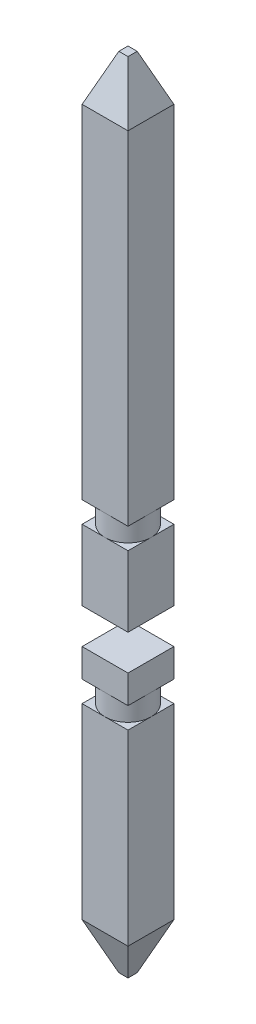
ISO-10303-21;
HEADER;
FILE_DESCRIPTION(('STEP AP214'),'2;1');
FILE_NAME('part.step','',(''),(''),'','','');
FILE_SCHEMA(('AUTOMOTIVE_DESIGN { 1 0 10303 214 1 1 1 1 }'));
ENDSEC;
DATA;
#1=APPLICATION_CONTEXT('core data for automotive mechanical design processes');
#2=APPLICATION_PROTOCOL_DEFINITION('international standard','automotive_design',2000,#1);
#3=PRODUCT_CONTEXT('',#1,'mechanical');
#4=PRODUCT('Part','Part','',(#3));
#5=PRODUCT_RELATED_PRODUCT_CATEGORY('part','',(#4));
#6=PRODUCT_DEFINITION_FORMATION('','',#4);
#7=PRODUCT_DEFINITION_CONTEXT('part definition',#1,'design');
#8=PRODUCT_DEFINITION('design','',#6,#7);
#9=PRODUCT_DEFINITION_SHAPE('','',#8);
#10=(LENGTH_UNIT() NAMED_UNIT(*) SI_UNIT(.MILLI.,.METRE.));
#11=(NAMED_UNIT(*) PLANE_ANGLE_UNIT() SI_UNIT($,.RADIAN.));
#12=(NAMED_UNIT(*) SI_UNIT($,.STERADIAN.) SOLID_ANGLE_UNIT());
#13=UNCERTAINTY_MEASURE_WITH_UNIT(LENGTH_MEASURE(1.E-05),#10,'distance_accuracy_value','');
#14=(GEOMETRIC_REPRESENTATION_CONTEXT(3) GLOBAL_UNCERTAINTY_ASSIGNED_CONTEXT((#13)) GLOBAL_UNIT_ASSIGNED_CONTEXT((#10,
#11,#12)) REPRESENTATION_CONTEXT('',''));
#15=CARTESIAN_POINT('',(0.,0.,0.));
#16=DIRECTION('',(0.,0.,1.));
#17=DIRECTION('',(1.,0.,0.));
#18=AXIS2_PLACEMENT_3D('',#15,#16,#17);
#19=CARTESIAN_POINT('',(-0.325,5.8,-0.325));
#20=DIRECTION('',(0.,1.,0.));
#21=DIRECTION('',(0.,0.,1.));
#22=AXIS2_PLACEMENT_3D('',#19,#20,#21);
#23=PLANE('',#22);
#24=DIRECTION('',(-1.,0.,0.));
#25=VECTOR('',#24,1.);
#26=CARTESIAN_POINT('',(-0.325,5.8,0.325));
#27=LINE('',#26,#25);
#28=CARTESIAN_POINT('',(0.325,5.8,0.325));
#29=VERTEX_POINT('',#28);
#30=CARTESIAN_POINT('',(0.,5.8,0.325));
#31=VERTEX_POINT('',#30);
#32=EDGE_CURVE('E208',#29,#31,#27,.T.);
#33=ORIENTED_EDGE('',*,*,#32,.T.);
#34=CARTESIAN_POINT('',(0.,5.8,0.));
#35=DIRECTION('',(0.,1.,0.));
#36=DIRECTION('',(0.,0.,1.));
#37=AXIS2_PLACEMENT_3D('',#34,#35,#36);
#38=CIRCLE('',#37,0.325);
#39=CARTESIAN_POINT('',(0.325,5.8,0.));
#40=VERTEX_POINT('',#39);
#41=EDGE_CURVE('E191',#31,#40,#38,.T.);
#42=ORIENTED_EDGE('',*,*,#41,.T.);
#43=DIRECTION('',(0.,0.,1.));
#44=VECTOR('',#43,1.);
#45=CARTESIAN_POINT('',(0.325,5.8,-0.325));
#46=LINE('',#45,#44);
#47=EDGE_CURVE('E202',#40,#29,#46,.T.);
#48=ORIENTED_EDGE('',*,*,#47,.T.);
#49=EDGE_LOOP('',(#33,#42,#48));
#50=FACE_BOUND('',#49,.T.);
#51=ADVANCED_FACE('F47',(#50),#23,.F.);
#52=CARTESIAN_POINT('',(0.325,5.8,-0.325));
#53=VERTEX_POINT('',#52);
#54=EDGE_CURVE('E199',#53,#40,#46,.T.);
#55=ORIENTED_EDGE('',*,*,#54,.T.);
#56=CARTESIAN_POINT('',(0.,5.8,-0.325));
#57=VERTEX_POINT('',#56);
#58=EDGE_CURVE('E197',#40,#57,#38,.T.);
#59=ORIENTED_EDGE('',*,*,#58,.T.);
#60=DIRECTION('',(-1.,0.,0.));
#61=VECTOR('',#60,1.);
#62=CARTESIAN_POINT('',(-0.325,5.8,-0.325));
#63=LINE('',#62,#61);
#64=EDGE_CURVE('E212',#53,#57,#63,.T.);
#65=ORIENTED_EDGE('',*,*,#64,.F.);
#66=EDGE_LOOP('',(#55,#59,#65));
#67=FACE_BOUND('',#66,.T.);
#68=ADVANCED_FACE('F296',(#67),#23,.F.);
#69=CARTESIAN_POINT('',(-0.325,5.8,-0.325));
#70=VERTEX_POINT('',#69);
#71=EDGE_CURVE('E216',#57,#70,#63,.T.);
#72=ORIENTED_EDGE('',*,*,#71,.F.);
#73=CARTESIAN_POINT('',(-0.325,5.8,0.));
#74=VERTEX_POINT('',#73);
#75=EDGE_CURVE('E329',#57,#74,#38,.T.);
#76=ORIENTED_EDGE('',*,*,#75,.T.);
#77=DIRECTION('',(0.,0.,1.));
#78=VECTOR('',#77,1.);
#79=CARTESIAN_POINT('',(-0.325,5.8,-0.325));
#80=LINE('',#79,#78);
#81=EDGE_CURVE('E203',#70,#74,#80,.T.);
#82=ORIENTED_EDGE('',*,*,#81,.F.);
#83=EDGE_LOOP('',(#72,#76,#82));
#84=FACE_BOUND('',#83,.T.);
#85=ADVANCED_FACE('F303',(#84),#23,.F.);
#86=CARTESIAN_POINT('',(0.325,11.3,0.325));
#87=DIRECTION('',(-1.,0.,0.));
#88=DIRECTION('',(0.,0.,1.));
#89=AXIS2_PLACEMENT_3D('',#86,#87,#88);
#90=PLANE('',#89);
#91=DIRECTION('',(0.,-1.,0.));
#92=VECTOR('',#91,1.);
#93=CARTESIAN_POINT('',(0.325,11.3,-0.325));
#94=LINE('',#93,#92);
#95=CARTESIAN_POINT('',(0.325,10.65,-0.325));
#96=VERTEX_POINT('',#95);
#97=EDGE_CURVE('E219',#96,#53,#94,.T.);
#98=ORIENTED_EDGE('',*,*,#97,.F.);
#99=DIRECTION('',(0.,0.,1.));
#100=VECTOR('',#99,1.);
#101=CARTESIAN_POINT('',(0.325,10.65,0.325));
#102=LINE('',#101,#100);
#103=CARTESIAN_POINT('',(0.325,10.65,0.325));
#104=VERTEX_POINT('',#103);
#105=EDGE_CURVE('E12',#96,#104,#102,.T.);
#106=ORIENTED_EDGE('',*,*,#105,.T.);
#107=DIRECTION('',(0.,-1.,0.));
#108=VECTOR('',#107,1.);
#109=CARTESIAN_POINT('',(0.325,11.3,0.325));
#110=LINE('',#109,#108);
#111=EDGE_CURVE('E196',#104,#29,#110,.T.);
#112=ORIENTED_EDGE('',*,*,#111,.T.);
#113=ORIENTED_EDGE('',*,*,#47,.F.);
#114=ORIENTED_EDGE('',*,*,#54,.F.);
#115=EDGE_LOOP('',(#98,#106,#112,#113,#114));
#116=FACE_BOUND('',#115,.T.);
#117=ADVANCED_FACE('F318',(#116),#90,.F.);
#118=CARTESIAN_POINT('',(-0.325,11.3,-0.325));
#119=DIRECTION('',(0.,0.,1.));
#120=DIRECTION('',(1.,0.,0.));
#121=AXIS2_PLACEMENT_3D('',#118,#119,#120);
#122=PLANE('',#121);
#123=DIRECTION('',(0.,-1.,0.));
#124=VECTOR('',#123,1.);
#125=CARTESIAN_POINT('',(-0.325,11.3,-0.325));
#126=LINE('',#125,#124);
#127=CARTESIAN_POINT('',(-0.325,10.65,-0.325));
#128=VERTEX_POINT('',#127);
#129=EDGE_CURVE('E215',#128,#70,#126,.T.);
#130=ORIENTED_EDGE('',*,*,#129,.F.);
#131=DIRECTION('',(1.,0.,0.));
#132=VECTOR('',#131,1.);
#133=CARTESIAN_POINT('',(-0.325,10.65,-0.325));
#134=LINE('',#133,#132);
#135=EDGE_CURVE('E231',#128,#96,#134,.T.);
#136=ORIENTED_EDGE('',*,*,#135,.T.);
#137=ORIENTED_EDGE('',*,*,#97,.T.);
#138=ORIENTED_EDGE('',*,*,#64,.T.);
#139=ORIENTED_EDGE('',*,*,#71,.T.);
#140=EDGE_LOOP('',(#130,#136,#137,#138,#139));
#141=FACE_BOUND('',#140,.T.);
#142=ADVANCED_FACE('F323',(#141),#122,.F.);
#143=CARTESIAN_POINT('',(-0.325,11.3,0.325));
#144=DIRECTION('',(1.,0.,0.));
#145=DIRECTION('',(0.,0.,-1.));
#146=AXIS2_PLACEMENT_3D('',#143,#144,#145);
#147=PLANE('',#146);
#148=DIRECTION('',(0.,-1.,0.));
#149=VECTOR('',#148,1.);
#150=CARTESIAN_POINT('',(-0.325,11.3,0.325));
#151=LINE('',#150,#149);
#152=CARTESIAN_POINT('',(-0.325,10.65,0.325));
#153=VERTEX_POINT('',#152);
#154=CARTESIAN_POINT('',(-0.325,5.8,0.325));
#155=VERTEX_POINT('',#154);
#156=EDGE_CURVE('E206',#153,#155,#151,.T.);
#157=ORIENTED_EDGE('',*,*,#156,.F.);
#158=DIRECTION('',(0.,0.,-1.));
#159=VECTOR('',#158,1.);
#160=CARTESIAN_POINT('',(-0.325,10.65,0.325));
#161=LINE('',#160,#159);
#162=EDGE_CURVE('E234',#153,#128,#161,.T.);
#163=ORIENTED_EDGE('',*,*,#162,.T.);
#164=ORIENTED_EDGE('',*,*,#129,.T.);
#165=ORIENTED_EDGE('',*,*,#81,.T.);
#166=EDGE_CURVE('E207',#74,#155,#80,.T.);
#167=ORIENTED_EDGE('',*,*,#166,.T.);
#168=EDGE_LOOP('',(#157,#163,#164,#165,#167));
#169=FACE_BOUND('',#168,.T.);
#170=ADVANCED_FACE('F343',(#169),#147,.F.);
#171=CARTESIAN_POINT('',(-0.325,11.3,0.325));
#172=DIRECTION('',(0.,0.,-1.));
#173=DIRECTION('',(-1.,0.,0.));
#174=AXIS2_PLACEMENT_3D('',#171,#172,#173);
#175=PLANE('',#174);
#176=ORIENTED_EDGE('',*,*,#111,.F.);
#177=DIRECTION('',(-1.,0.,0.));
#178=VECTOR('',#177,1.);
#179=CARTESIAN_POINT('',(-0.325,10.65,0.325));
#180=LINE('',#179,#178);
#181=EDGE_CURVE('E57',#104,#153,#180,.T.);
#182=ORIENTED_EDGE('',*,*,#181,.T.);
#183=ORIENTED_EDGE('',*,*,#156,.T.);
#184=EDGE_CURVE('E211',#31,#155,#27,.T.);
#185=ORIENTED_EDGE('',*,*,#184,.F.);
#186=ORIENTED_EDGE('',*,*,#32,.F.);
#187=EDGE_LOOP('',(#176,#182,#183,#185,#186));
#188=FACE_BOUND('',#187,.T.);
#189=ADVANCED_FACE('F314',(#188),#175,.F.);
#190=CARTESIAN_POINT('',(0.,11.3,0.));
#191=DIRECTION('',(0.,-1.,0.));
#192=DIRECTION('',(0.,0.,-1.));
#193=AXIS2_PLACEMENT_3D('',#190,#191,#192);
#194=PLANE('',#193);
#195=DIRECTION('',(0.,0.,-1.));
#196=VECTOR('',#195,1.);
#197=CARTESIAN_POINT('',(0.0649999999999989,11.3,0.));
#198=LINE('',#197,#196);
#199=CARTESIAN_POINT('',(0.0649999999999989,11.3,0.0649999999999989));
#200=VERTEX_POINT('',#199);
#201=CARTESIAN_POINT('',(0.0649999999999989,11.3,-0.0649999999999989));
#202=VERTEX_POINT('',#201);
#203=EDGE_CURVE('E222',#200,#202,#198,.T.);
#204=ORIENTED_EDGE('',*,*,#203,.T.);
#205=DIRECTION('',(-1.,0.,0.));
#206=VECTOR('',#205,1.);
#207=CARTESIAN_POINT('',(0.,11.3,-0.0649999999999989));
#208=LINE('',#207,#206);
#209=CARTESIAN_POINT('',(-0.0649999999999989,11.3,-0.0649999999999989));
#210=VERTEX_POINT('',#209);
#211=EDGE_CURVE('E228',#202,#210,#208,.T.);
#212=ORIENTED_EDGE('',*,*,#211,.T.);
#213=DIRECTION('',(0.,0.,1.));
#214=VECTOR('',#213,1.);
#215=CARTESIAN_POINT('',(-0.0649999999999989,11.3,0.));
#216=LINE('',#215,#214);
#217=CARTESIAN_POINT('',(-0.0649999999999989,11.3,0.0649999999999989));
#218=VERTEX_POINT('',#217);
#219=EDGE_CURVE('E226',#210,#218,#216,.T.);
#220=ORIENTED_EDGE('',*,*,#219,.T.);
#221=DIRECTION('',(1.,0.,0.));
#222=VECTOR('',#221,1.);
#223=CARTESIAN_POINT('',(0.,11.3,0.0649999999999989));
#224=LINE('',#223,#222);
#225=EDGE_CURVE('E224',#218,#200,#224,.T.);
#226=ORIENTED_EDGE('',*,*,#225,.T.);
#227=EDGE_LOOP('',(#204,#212,#220,#226));
#228=FACE_BOUND('',#227,.T.);
#229=ADVANCED_FACE('F308',(#228),#194,.F.);
#230=ORIENTED_EDGE('',*,*,#166,.F.);
#231=EDGE_CURVE('E198',#74,#31,#38,.T.);
#232=ORIENTED_EDGE('',*,*,#231,.T.);
#233=ORIENTED_EDGE('',*,*,#184,.T.);
#234=EDGE_LOOP('',(#230,#232,#233));
#235=FACE_BOUND('',#234,.T.);
#236=ADVANCED_FACE('F299',(#235),#23,.F.);
#237=CARTESIAN_POINT('',(0.,6.71923881554251,0.));
#238=DIRECTION('',(0.,-1.,0.));
#239=DIRECTION('',(0.,0.,-1.));
#240=AXIS2_PLACEMENT_3D('',#237,#238,#239);
#241=CYLINDRICAL_SURFACE('',#240,0.325);
#242=CARTESIAN_POINT('',(0.,5.5,0.));
#243=DIRECTION('',(0.,1.,0.));
#244=DIRECTION('',(0.,0.,1.));
#245=AXIS2_PLACEMENT_3D('',#242,#243,#244);
#246=CIRCLE('',#245,0.325);
#247=CARTESIAN_POINT('',(0.,5.5,0.325));
#248=VERTEX_POINT('',#247);
#249=CARTESIAN_POINT('',(0.325,5.5,0.));
#250=VERTEX_POINT('',#249);
#251=EDGE_CURVE('E188',#248,#250,#246,.T.);
#252=ORIENTED_EDGE('',*,*,#251,.T.);
#253=CARTESIAN_POINT('',(0.,5.5,-0.325));
#254=VERTEX_POINT('',#253);
#255=EDGE_CURVE('E192',#250,#254,#246,.T.);
#256=ORIENTED_EDGE('',*,*,#255,.T.);
#257=CARTESIAN_POINT('',(-0.325,5.5,0.));
#258=VERTEX_POINT('',#257);
#259=EDGE_CURVE('E154',#254,#258,#246,.T.);
#260=ORIENTED_EDGE('',*,*,#259,.T.);
#261=EDGE_CURVE('E193',#258,#248,#246,.T.);
#262=ORIENTED_EDGE('',*,*,#261,.T.);
#263=EDGE_LOOP('',(#252,#256,#260,#262));
#264=FACE_BOUND('',#263,.T.);
#265=ORIENTED_EDGE('',*,*,#41,.F.);
#266=ORIENTED_EDGE('',*,*,#231,.F.);
#267=ORIENTED_EDGE('',*,*,#75,.F.);
#268=ORIENTED_EDGE('',*,*,#58,.F.);
#269=EDGE_LOOP('',(#265,#266,#267,#268));
#270=FACE_BOUND('',#269,.T.);
#271=ADVANCED_FACE('F277',(#264,#270),#241,.T.);
#272=CARTESIAN_POINT('',(-0.325,5.5,-0.325));
#273=DIRECTION('',(0.,-1.,0.));
#274=DIRECTION('',(0.,0.,-1.));
#275=AXIS2_PLACEMENT_3D('',#272,#273,#274);
#276=PLANE('',#275);
#277=ORIENTED_EDGE('',*,*,#251,.F.);
#278=DIRECTION('',(1.,0.,0.));
#279=VECTOR('',#278,1.);
#280=CARTESIAN_POINT('',(-0.325,5.5,0.325));
#281=LINE('',#280,#279);
#282=CARTESIAN_POINT('',(0.325,5.5,0.325));
#283=VERTEX_POINT('',#282);
#284=EDGE_CURVE('E247',#248,#283,#281,.T.);
#285=ORIENTED_EDGE('',*,*,#284,.T.);
#286=DIRECTION('',(0.,0.,1.));
#287=VECTOR('',#286,1.);
#288=CARTESIAN_POINT('',(0.325,5.5,-0.325));
#289=LINE('',#288,#287);
#290=EDGE_CURVE('E169',#250,#283,#289,.T.);
#291=ORIENTED_EDGE('',*,*,#290,.F.);
#292=EDGE_LOOP('',(#277,#285,#291));
#293=FACE_BOUND('',#292,.T.);
#294=ADVANCED_FACE('F283',(#293),#276,.F.);
#295=ORIENTED_EDGE('',*,*,#255,.F.);
#296=CARTESIAN_POINT('',(0.325,5.5,-0.325));
#297=VERTEX_POINT('',#296);
#298=EDGE_CURVE('E187',#297,#250,#289,.T.);
#299=ORIENTED_EDGE('',*,*,#298,.F.);
#300=DIRECTION('',(1.,0.,0.));
#301=VECTOR('',#300,1.);
#302=CARTESIAN_POINT('',(-0.325,5.5,-0.325));
#303=LINE('',#302,#301);
#304=EDGE_CURVE('E160',#254,#297,#303,.T.);
#305=ORIENTED_EDGE('',*,*,#304,.F.);
#306=EDGE_LOOP('',(#295,#299,#305));
#307=FACE_BOUND('',#306,.T.);
#308=ADVANCED_FACE('F281',(#307),#276,.F.);
#309=ORIENTED_EDGE('',*,*,#259,.F.);
#310=CARTESIAN_POINT('',(-0.325,5.5,-0.325));
#311=VERTEX_POINT('',#310);
#312=EDGE_CURVE('E149',#311,#254,#303,.T.);
#313=ORIENTED_EDGE('',*,*,#312,.F.);
#314=DIRECTION('',(0.,0.,1.));
#315=VECTOR('',#314,1.);
#316=CARTESIAN_POINT('',(-0.325,5.5,-0.325));
#317=LINE('',#316,#315);
#318=EDGE_CURVE('E152',#311,#258,#317,.T.);
#319=ORIENTED_EDGE('',*,*,#318,.T.);
#320=EDGE_LOOP('',(#309,#313,#319));
#321=FACE_BOUND('',#320,.T.);
#322=ADVANCED_FACE('F151',(#321),#276,.F.);
#323=CARTESIAN_POINT('',(-0.325,4.5,-0.325));
#324=DIRECTION('',(0.,1.,0.));
#325=DIRECTION('',(0.,0.,1.));
#326=AXIS2_PLACEMENT_3D('',#323,#324,#325);
#327=PLANE('',#326);
#328=DIRECTION('',(-1.,0.,0.));
#329=VECTOR('',#328,1.);
#330=CARTESIAN_POINT('',(-0.325,4.5,0.325));
#331=LINE('',#330,#329);
#332=CARTESIAN_POINT('',(0.325,4.5,0.325));
#333=VERTEX_POINT('',#332);
#334=CARTESIAN_POINT('',(-0.325,4.5,0.325));
#335=VERTEX_POINT('',#334);
#336=EDGE_CURVE('E184',#333,#335,#331,.T.);
#337=ORIENTED_EDGE('',*,*,#336,.T.);
#338=DIRECTION('',(0.,0.,1.));
#339=VECTOR('',#338,1.);
#340=CARTESIAN_POINT('',(-0.325,4.5,-0.325));
#341=LINE('',#340,#339);
#342=CARTESIAN_POINT('',(-0.325,4.5,-0.325));
#343=VERTEX_POINT('',#342);
#344=EDGE_CURVE('E175',#343,#335,#341,.T.);
#345=ORIENTED_EDGE('',*,*,#344,.F.);
#346=DIRECTION('',(-1.,0.,0.));
#347=VECTOR('',#346,1.);
#348=CARTESIAN_POINT('',(-0.325,4.5,-0.325));
#349=LINE('',#348,#347);
#350=CARTESIAN_POINT('',(0.325,4.5,-0.325));
#351=VERTEX_POINT('',#350);
#352=EDGE_CURVE('E174',#351,#343,#349,.T.);
#353=ORIENTED_EDGE('',*,*,#352,.F.);
#354=DIRECTION('',(0.,0.,1.));
#355=VECTOR('',#354,1.);
#356=CARTESIAN_POINT('',(0.325,4.5,-0.325));
#357=LINE('',#356,#355);
#358=EDGE_CURVE('E262',#351,#333,#357,.T.);
#359=ORIENTED_EDGE('',*,*,#358,.T.);
#360=EDGE_LOOP('',(#337,#345,#353,#359));
#361=FACE_BOUND('',#360,.T.);
#362=ADVANCED_FACE('F268',(#361),#327,.F.);
#363=CARTESIAN_POINT('',(-0.325,11.3,0.325));
#364=DIRECTION('',(0.,0.,-1.));
#365=DIRECTION('',(-1.,0.,0.));
#366=AXIS2_PLACEMENT_3D('',#363,#364,#365);
#367=PLANE('',#366);
#368=DIRECTION('',(0.,-1.,0.));
#369=VECTOR('',#368,1.);
#370=CARTESIAN_POINT('',(0.325,11.3,0.325));
#371=LINE('',#370,#369);
#372=EDGE_CURVE('E185',#283,#333,#371,.T.);
#373=ORIENTED_EDGE('',*,*,#372,.F.);
#374=ORIENTED_EDGE('',*,*,#284,.F.);
#375=CARTESIAN_POINT('',(-0.325,5.5,0.325));
#376=VERTEX_POINT('',#375);
#377=EDGE_CURVE('E252',#376,#248,#281,.T.);
#378=ORIENTED_EDGE('',*,*,#377,.F.);
#379=DIRECTION('',(0.,-1.,0.));
#380=VECTOR('',#379,1.);
#381=CARTESIAN_POINT('',(-0.325,11.3,0.325));
#382=LINE('',#381,#380);
#383=EDGE_CURVE('E177',#376,#335,#382,.T.);
#384=ORIENTED_EDGE('',*,*,#383,.T.);
#385=ORIENTED_EDGE('',*,*,#336,.F.);
#386=EDGE_LOOP('',(#373,#374,#378,#384,#385));
#387=FACE_BOUND('',#386,.T.);
#388=ADVANCED_FACE('F272',(#387),#367,.F.);
#389=CARTESIAN_POINT('',(-0.325,11.3,0.325));
#390=DIRECTION('',(1.,0.,0.));
#391=DIRECTION('',(0.,0.,-1.));
#392=AXIS2_PLACEMENT_3D('',#389,#390,#391);
#393=PLANE('',#392);
#394=ORIENTED_EDGE('',*,*,#383,.F.);
#395=EDGE_CURVE('E159',#258,#376,#317,.T.);
#396=ORIENTED_EDGE('',*,*,#395,.F.);
#397=ORIENTED_EDGE('',*,*,#318,.F.);
#398=DIRECTION('',(0.,-1.,0.));
#399=VECTOR('',#398,1.);
#400=CARTESIAN_POINT('',(-0.325,11.3,-0.325));
#401=LINE('',#400,#399);
#402=EDGE_CURVE('E167',#311,#343,#401,.T.);
#403=ORIENTED_EDGE('',*,*,#402,.T.);
#404=ORIENTED_EDGE('',*,*,#344,.T.);
#405=EDGE_LOOP('',(#394,#396,#397,#403,#404));
#406=FACE_BOUND('',#405,.T.);
#407=ADVANCED_FACE('F165',(#406),#393,.F.);
#408=CARTESIAN_POINT('',(-0.325,11.3,-0.325));
#409=DIRECTION('',(0.,0.,1.));
#410=DIRECTION('',(1.,0.,0.));
#411=AXIS2_PLACEMENT_3D('',#408,#409,#410);
#412=PLANE('',#411);
#413=ORIENTED_EDGE('',*,*,#402,.F.);
#414=ORIENTED_EDGE('',*,*,#312,.T.);
#415=ORIENTED_EDGE('',*,*,#304,.T.);
#416=DIRECTION('',(0.,-1.,0.));
#417=VECTOR('',#416,1.);
#418=CARTESIAN_POINT('',(0.325,11.3,-0.325));
#419=LINE('',#418,#417);
#420=EDGE_CURVE('E179',#297,#351,#419,.T.);
#421=ORIENTED_EDGE('',*,*,#420,.T.);
#422=ORIENTED_EDGE('',*,*,#352,.T.);
#423=EDGE_LOOP('',(#413,#414,#415,#421,#422));
#424=FACE_BOUND('',#423,.T.);
#425=ADVANCED_FACE('F172',(#424),#412,.F.);
#426=CARTESIAN_POINT('',(0.325,11.3,0.325));
#427=DIRECTION('',(-1.,0.,0.));
#428=DIRECTION('',(0.,0.,1.));
#429=AXIS2_PLACEMENT_3D('',#426,#427,#428);
#430=PLANE('',#429);
#431=ORIENTED_EDGE('',*,*,#420,.F.);
#432=ORIENTED_EDGE('',*,*,#298,.T.);
#433=ORIENTED_EDGE('',*,*,#290,.T.);
#434=ORIENTED_EDGE('',*,*,#372,.T.);
#435=ORIENTED_EDGE('',*,*,#358,.F.);
#436=EDGE_LOOP('',(#431,#432,#433,#434,#435));
#437=FACE_BOUND('',#436,.T.);
#438=ADVANCED_FACE('F285',(#437),#430,.F.);
#439=ORIENTED_EDGE('',*,*,#261,.F.);
#440=ORIENTED_EDGE('',*,*,#395,.T.);
#441=ORIENTED_EDGE('',*,*,#377,.T.);
#442=EDGE_LOOP('',(#439,#440,#441));
#443=FACE_BOUND('',#442,.T.);
#444=ADVANCED_FACE('F274',(#443),#276,.F.);
#445=CARTESIAN_POINT('',(0.,11.3,0.0649999999999989));
#446=DIRECTION('',(0.,-0.371390676354102,-0.92847669088526));
#447=DIRECTION('',(1.,0.,0.));
#448=AXIS2_PLACEMENT_3D('',#445,#446,#447);
#449=PLANE('',#448);
#450=DIRECTION('',(-0.348155311911394,-0.87038827977849,0.348155311911394));
#451=VECTOR('',#450,1.);
#452=CARTESIAN_POINT('',(-0.0571212121212112,11.319696969697,0.0571212121212112));
#453=LINE('',#452,#451);
#454=EDGE_CURVE('E240',#153,#218,#453,.F.);
#455=ORIENTED_EDGE('',*,*,#454,.F.);
#456=ORIENTED_EDGE('',*,*,#181,.F.);
#457=DIRECTION('',(0.348155311911394,-0.87038827977849,0.348155311911394));
#458=VECTOR('',#457,1.);
#459=CARTESIAN_POINT('',(0.0571212121212112,11.319696969697,0.0571212121212112));
#460=LINE('',#459,#458);
#461=EDGE_CURVE('E52',#200,#104,#460,.T.);
#462=ORIENTED_EDGE('',*,*,#461,.F.);
#463=ORIENTED_EDGE('',*,*,#225,.F.);
#464=EDGE_LOOP('',(#455,#456,#462,#463));
#465=FACE_BOUND('',#464,.T.);
#466=ADVANCED_FACE('F50',(#465),#449,.F.);
#467=CARTESIAN_POINT('',(0.0649999999999989,11.3,0.));
#468=DIRECTION('',(-0.92847669088526,-0.371390676354102,0.));
#469=DIRECTION('',(0.,0.,-1.));
#470=AXIS2_PLACEMENT_3D('',#467,#468,#469);
#471=PLANE('',#470);
#472=ORIENTED_EDGE('',*,*,#461,.T.);
#473=ORIENTED_EDGE('',*,*,#105,.F.);
#474=DIRECTION('',(-0.348155311911394,0.87038827977849,0.348155311911394));
#475=VECTOR('',#474,1.);
#476=CARTESIAN_POINT('',(0.0571212121212112,11.319696969697,-0.0571212121212112));
#477=LINE('',#476,#475);
#478=EDGE_CURVE('E239',#202,#96,#477,.F.);
#479=ORIENTED_EDGE('',*,*,#478,.F.);
#480=ORIENTED_EDGE('',*,*,#203,.F.);
#481=EDGE_LOOP('',(#472,#473,#479,#480));
#482=FACE_BOUND('',#481,.T.);
#483=ADVANCED_FACE('F352',(#482),#471,.F.);
#484=CARTESIAN_POINT('',(-0.0649999999999989,11.3,0.));
#485=DIRECTION('',(0.92847669088526,-0.371390676354102,0.));
#486=DIRECTION('',(0.,0.,1.));
#487=AXIS2_PLACEMENT_3D('',#484,#485,#486);
#488=PLANE('',#487);
#489=ORIENTED_EDGE('',*,*,#454,.T.);
#490=ORIENTED_EDGE('',*,*,#219,.F.);
#491=DIRECTION('',(-0.348155311911394,-0.87038827977849,-0.348155311911394));
#492=VECTOR('',#491,1.);
#493=CARTESIAN_POINT('',(-0.0571212121212112,11.319696969697,-0.0571212121212112));
#494=LINE('',#493,#492);
#495=EDGE_CURVE('E237',#128,#210,#494,.F.);
#496=ORIENTED_EDGE('',*,*,#495,.F.);
#497=ORIENTED_EDGE('',*,*,#162,.F.);
#498=EDGE_LOOP('',(#489,#490,#496,#497));
#499=FACE_BOUND('',#498,.T.);
#500=ADVANCED_FACE('F350',(#499),#488,.F.);
#501=CARTESIAN_POINT('',(0.,11.3,-0.0649999999999989));
#502=DIRECTION('',(0.,-0.371390676354102,0.92847669088526));
#503=DIRECTION('',(-1.,0.,0.));
#504=AXIS2_PLACEMENT_3D('',#501,#502,#503);
#505=PLANE('',#504);
#506=ORIENTED_EDGE('',*,*,#478,.T.);
#507=ORIENTED_EDGE('',*,*,#135,.F.);
#508=ORIENTED_EDGE('',*,*,#495,.T.);
#509=ORIENTED_EDGE('',*,*,#211,.F.);
#510=EDGE_LOOP('',(#506,#507,#508,#509));
#511=FACE_BOUND('',#510,.T.);
#512=ADVANCED_FACE('F347',(#511),#505,.F.);
#513=CLOSED_SHELL('',(#51,#68,#85,#117,#142,#170,#189,#229,#236,#271,#294,#308,#322,#362,#388,
#407,#425,#438,#444,#466,#483,#500,#512));
#514=MANIFOLD_SOLID_BREP('B2',#513);
#515=CARTESIAN_POINT('',(-0.325,3.3,-0.325));
#516=DIRECTION('',(0.,-1.,0.));
#517=DIRECTION('',(0.,0.,-1.));
#518=AXIS2_PLACEMENT_3D('',#515,#516,#517);
#519=PLANE('',#518);
#520=CARTESIAN_POINT('',(0.,3.3,0.));
#521=DIRECTION('',(0.,1.,0.));
#522=DIRECTION('',(0.,0.,1.));
#523=AXIS2_PLACEMENT_3D('',#520,#521,#522);
#524=CIRCLE('',#523,0.325);
#525=CARTESIAN_POINT('',(0.,3.3,0.325));
#526=VERTEX_POINT('',#525);
#527=CARTESIAN_POINT('',(0.325,3.3,0.));
#528=VERTEX_POINT('',#527);
#529=EDGE_CURVE('E643',#526,#528,#524,.T.);
#530=ORIENTED_EDGE('',*,*,#529,.F.);
#531=DIRECTION('',(1.,0.,0.));
#532=VECTOR('',#531,1.);
#533=CARTESIAN_POINT('',(-0.325,3.3,0.325));
#534=LINE('',#533,#532);
#535=CARTESIAN_POINT('',(0.325,3.3,0.325));
#536=VERTEX_POINT('',#535);
#537=EDGE_CURVE('E672',#526,#536,#534,.T.);
#538=ORIENTED_EDGE('',*,*,#537,.T.);
#539=DIRECTION('',(0.,0.,1.));
#540=VECTOR('',#539,1.);
#541=CARTESIAN_POINT('',(0.325,3.3,-0.325));
#542=LINE('',#541,#540);
#543=EDGE_CURVE('E684',#528,#536,#542,.T.);
#544=ORIENTED_EDGE('',*,*,#543,.F.);
#545=EDGE_LOOP('',(#530,#538,#544));
#546=FACE_BOUND('',#545,.T.);
#547=ADVANCED_FACE('F518',(#546),#519,.F.);
#548=CARTESIAN_POINT('',(0.,3.3,-0.325));
#549=VERTEX_POINT('',#548);
#550=EDGE_CURVE('E667',#528,#549,#524,.T.);
#551=ORIENTED_EDGE('',*,*,#550,.F.);
#552=CARTESIAN_POINT('',(0.325,3.3,-0.325));
#553=VERTEX_POINT('',#552);
#554=EDGE_CURVE('E680',#553,#528,#542,.T.);
#555=ORIENTED_EDGE('',*,*,#554,.F.);
#556=DIRECTION('',(1.,0.,0.));
#557=VECTOR('',#556,1.);
#558=CARTESIAN_POINT('',(-0.325,3.3,-0.325));
#559=LINE('',#558,#557);
#560=EDGE_CURVE('E677',#549,#553,#559,.T.);
#561=ORIENTED_EDGE('',*,*,#560,.F.);
#562=EDGE_LOOP('',(#551,#555,#561));
#563=FACE_BOUND('',#562,.T.);
#564=ADVANCED_FACE('F756',(#563),#519,.F.);
#565=CARTESIAN_POINT('',(-0.325,3.3,0.));
#566=VERTEX_POINT('',#565);
#567=EDGE_CURVE('E745',#549,#566,#524,.T.);
#568=ORIENTED_EDGE('',*,*,#567,.F.);
#569=CARTESIAN_POINT('',(-0.325,3.3,-0.325));
#570=VERTEX_POINT('',#569);
#571=EDGE_CURVE('E673',#570,#549,#559,.T.);
#572=ORIENTED_EDGE('',*,*,#571,.F.);
#573=DIRECTION('',(0.,0.,1.));
#574=VECTOR('',#573,1.);
#575=CARTESIAN_POINT('',(-0.325,3.3,-0.325));
#576=LINE('',#575,#574);
#577=EDGE_CURVE('E685',#570,#566,#576,.T.);
#578=ORIENTED_EDGE('',*,*,#577,.T.);
#579=EDGE_LOOP('',(#568,#572,#578));
#580=FACE_BOUND('',#579,.T.);
#581=ADVANCED_FACE('F744',(#580),#519,.F.);
#582=CARTESIAN_POINT('',(0.,0.,0.));
#583=DIRECTION('',(0.,-1.,0.));
#584=DIRECTION('',(0.,0.,-1.));
#585=AXIS2_PLACEMENT_3D('',#582,#583,#584);
#586=PLANE('',#585);
#587=DIRECTION('',(0.,0.,-1.));
#588=VECTOR('',#587,1.);
#589=CARTESIAN_POINT('',(-0.0649999999999997,0.,-0.325));
#590=LINE('',#589,#588);
#591=CARTESIAN_POINT('',(-0.0649999999999997,0.,0.0649999999999997));
#592=VERTEX_POINT('',#591);
#593=CARTESIAN_POINT('',(-0.0649999999999997,0.,-0.0649999999999997));
#594=VERTEX_POINT('',#593);
#595=EDGE_CURVE('E703',#592,#594,#590,.T.);
#596=ORIENTED_EDGE('',*,*,#595,.T.);
#597=DIRECTION('',(1.,0.,0.));
#598=VECTOR('',#597,1.);
#599=CARTESIAN_POINT('',(0.325,0.,-0.0649999999999997));
#600=LINE('',#599,#598);
#601=CARTESIAN_POINT('',(0.0649999999999997,0.,-0.0649999999999997));
#602=VERTEX_POINT('',#601);
#603=EDGE_CURVE('E705',#594,#602,#600,.T.);
#604=ORIENTED_EDGE('',*,*,#603,.T.);
#605=DIRECTION('',(0.,0.,1.));
#606=VECTOR('',#605,1.);
#607=CARTESIAN_POINT('',(0.0649999999999997,0.,0.325));
#608=LINE('',#607,#606);
#609=CARTESIAN_POINT('',(0.0649999999999997,0.,0.0649999999999997));
#610=VERTEX_POINT('',#609);
#611=EDGE_CURVE('E699',#602,#610,#608,.T.);
#612=ORIENTED_EDGE('',*,*,#611,.T.);
#613=DIRECTION('',(-1.,0.,0.));
#614=VECTOR('',#613,1.);
#615=CARTESIAN_POINT('',(-0.325,0.,0.0649999999999997));
#616=LINE('',#615,#614);
#617=EDGE_CURVE('E701',#610,#592,#616,.T.);
#618=ORIENTED_EDGE('',*,*,#617,.T.);
#619=EDGE_LOOP('',(#596,#604,#612,#618));
#620=FACE_BOUND('',#619,.T.);
#621=ADVANCED_FACE('F728',(#620),#586,.T.);
#622=CARTESIAN_POINT('',(0.325,11.3,0.325));
#623=DIRECTION('',(-1.,0.,0.));
#624=DIRECTION('',(0.,0.,1.));
#625=AXIS2_PLACEMENT_3D('',#622,#623,#624);
#626=PLANE('',#625);
#627=DIRECTION('',(0.,-1.,0.));
#628=VECTOR('',#627,1.);
#629=CARTESIAN_POINT('',(0.325,11.3,0.325));
#630=LINE('',#629,#628);
#631=CARTESIAN_POINT('',(0.325,0.650000000000005,0.325));
#632=VERTEX_POINT('',#631);
#633=EDGE_CURVE('E683',#536,#632,#630,.T.);
#634=ORIENTED_EDGE('',*,*,#633,.T.);
#635=DIRECTION('',(0.,0.,-1.));
#636=VECTOR('',#635,1.);
#637=CARTESIAN_POINT('',(0.325,0.650000000000005,-0.325));
#638=LINE('',#637,#636);
#639=CARTESIAN_POINT('',(0.325,0.650000000000005,-0.325));
#640=VERTEX_POINT('',#639);
#641=EDGE_CURVE('E45',#632,#640,#638,.T.);
#642=ORIENTED_EDGE('',*,*,#641,.T.);
#643=DIRECTION('',(0.,-1.,0.));
#644=VECTOR('',#643,1.);
#645=CARTESIAN_POINT('',(0.325,11.3,-0.325));
#646=LINE('',#645,#644);
#647=EDGE_CURVE('E693',#553,#640,#646,.T.);
#648=ORIENTED_EDGE('',*,*,#647,.F.);
#649=ORIENTED_EDGE('',*,*,#554,.T.);
#650=ORIENTED_EDGE('',*,*,#543,.T.);
#651=EDGE_LOOP('',(#634,#642,#648,#649,#650));
#652=FACE_BOUND('',#651,.T.);
#653=ADVANCED_FACE('F761',(#652),#626,.F.);
#654=CARTESIAN_POINT('',(-0.325,11.3,-0.325));
#655=DIRECTION('',(0.,0.,1.));
#656=DIRECTION('',(1.,0.,0.));
#657=AXIS2_PLACEMENT_3D('',#654,#655,#656);
#658=PLANE('',#657);
#659=ORIENTED_EDGE('',*,*,#647,.T.);
#660=DIRECTION('',(-1.,0.,0.));
#661=VECTOR('',#660,1.);
#662=CARTESIAN_POINT('',(-0.325,0.650000000000005,-0.325));
#663=LINE('',#662,#661);
#664=CARTESIAN_POINT('',(-0.325,0.650000000000005,-0.325));
#665=VERTEX_POINT('',#664);
#666=EDGE_CURVE('E696',#640,#665,#663,.T.);
#667=ORIENTED_EDGE('',*,*,#666,.T.);
#668=DIRECTION('',(0.,-1.,0.));
#669=VECTOR('',#668,1.);
#670=CARTESIAN_POINT('',(-0.325,11.3,-0.325));
#671=LINE('',#670,#669);
#672=EDGE_CURVE('E691',#570,#665,#671,.T.);
#673=ORIENTED_EDGE('',*,*,#672,.F.);
#674=ORIENTED_EDGE('',*,*,#571,.T.);
#675=ORIENTED_EDGE('',*,*,#560,.T.);
#676=EDGE_LOOP('',(#659,#667,#673,#674,#675));
#677=FACE_BOUND('',#676,.T.);
#678=ADVANCED_FACE('F737',(#677),#658,.F.);
#679=CARTESIAN_POINT('',(-0.325,11.3,0.325));
#680=DIRECTION('',(1.,0.,0.));
#681=DIRECTION('',(0.,0.,-1.));
#682=AXIS2_PLACEMENT_3D('',#679,#680,#681);
#683=PLANE('',#682);
#684=ORIENTED_EDGE('',*,*,#672,.T.);
#685=DIRECTION('',(0.,0.,1.));
#686=VECTOR('',#685,1.);
#687=CARTESIAN_POINT('',(-0.325,0.650000000000005,0.325));
#688=LINE('',#687,#686);
#689=CARTESIAN_POINT('',(-0.325,0.650000000000005,0.325));
#690=VERTEX_POINT('',#689);
#691=EDGE_CURVE('E543',#665,#690,#688,.T.);
#692=ORIENTED_EDGE('',*,*,#691,.T.);
#693=DIRECTION('',(0.,-1.,0.));
#694=VECTOR('',#693,1.);
#695=CARTESIAN_POINT('',(-0.325,11.3,0.325));
#696=LINE('',#695,#694);
#697=CARTESIAN_POINT('',(-0.325,3.3,0.325));
#698=VERTEX_POINT('',#697);
#699=EDGE_CURVE('E689',#698,#690,#696,.T.);
#700=ORIENTED_EDGE('',*,*,#699,.F.);
#701=EDGE_CURVE('E676',#566,#698,#576,.T.);
#702=ORIENTED_EDGE('',*,*,#701,.F.);
#703=ORIENTED_EDGE('',*,*,#577,.F.);
#704=EDGE_LOOP('',(#684,#692,#700,#702,#703));
#705=FACE_BOUND('',#704,.T.);
#706=ADVANCED_FACE('F740',(#705),#683,.F.);
#707=CARTESIAN_POINT('',(-0.325,11.3,0.325));
#708=DIRECTION('',(0.,0.,-1.));
#709=DIRECTION('',(-1.,0.,0.));
#710=AXIS2_PLACEMENT_3D('',#707,#708,#709);
#711=PLANE('',#710);
#712=ORIENTED_EDGE('',*,*,#699,.T.);
#713=DIRECTION('',(1.,0.,0.));
#714=VECTOR('',#713,1.);
#715=CARTESIAN_POINT('',(0.325,0.650000000000005,0.325));
#716=LINE('',#715,#714);
#717=EDGE_CURVE('E528',#690,#632,#716,.T.);
#718=ORIENTED_EDGE('',*,*,#717,.T.);
#719=ORIENTED_EDGE('',*,*,#633,.F.);
#720=ORIENTED_EDGE('',*,*,#537,.F.);
#721=EDGE_CURVE('E678',#698,#526,#534,.T.);
#722=ORIENTED_EDGE('',*,*,#721,.F.);
#723=EDGE_LOOP('',(#712,#718,#719,#720,#722));
#724=FACE_BOUND('',#723,.T.);
#725=ADVANCED_FACE('F762',(#724),#711,.F.);
#726=EDGE_CURVE('E668',#566,#526,#524,.T.);
#727=ORIENTED_EDGE('',*,*,#726,.F.);
#728=ORIENTED_EDGE('',*,*,#701,.T.);
#729=ORIENTED_EDGE('',*,*,#721,.T.);
#730=EDGE_LOOP('',(#727,#728,#729));
#731=FACE_BOUND('',#730,.T.);
#732=ADVANCED_FACE('F765',(#731),#519,.F.);
#733=CARTESIAN_POINT('',(0.,4.51923881554251,0.));
#734=DIRECTION('',(0.,-1.,0.));
#735=DIRECTION('',(0.,0.,-1.));
#736=AXIS2_PLACEMENT_3D('',#733,#734,#735);
#737=CYLINDRICAL_SURFACE('',#736,0.325);
#738=ORIENTED_EDGE('',*,*,#529,.T.);
#739=ORIENTED_EDGE('',*,*,#550,.T.);
#740=ORIENTED_EDGE('',*,*,#567,.T.);
#741=ORIENTED_EDGE('',*,*,#726,.T.);
#742=EDGE_LOOP('',(#738,#739,#740,#741));
#743=FACE_BOUND('',#742,.T.);
#744=CARTESIAN_POINT('',(0.,3.6,0.));
#745=DIRECTION('',(0.,1.,0.));
#746=DIRECTION('',(0.,0.,1.));
#747=AXIS2_PLACEMENT_3D('',#744,#745,#746);
#748=CIRCLE('',#747,0.325);
#749=CARTESIAN_POINT('',(0.,3.6,0.325));
#750=VERTEX_POINT('',#749);
#751=CARTESIAN_POINT('',(0.325,3.6,0.));
#752=VERTEX_POINT('',#751);
#753=EDGE_CURVE('E669',#750,#752,#748,.T.);
#754=ORIENTED_EDGE('',*,*,#753,.F.);
#755=CARTESIAN_POINT('',(-0.325,3.6,0.));
#756=VERTEX_POINT('',#755);
#757=EDGE_CURVE('E666',#756,#750,#748,.T.);
#758=ORIENTED_EDGE('',*,*,#757,.F.);
#759=CARTESIAN_POINT('',(0.,3.6,-0.325));
#760=VERTEX_POINT('',#759);
#761=EDGE_CURVE('E985',#760,#756,#748,.T.);
#762=ORIENTED_EDGE('',*,*,#761,.F.);
#763=EDGE_CURVE('E628',#752,#760,#748,.T.);
#764=ORIENTED_EDGE('',*,*,#763,.F.);
#765=EDGE_LOOP('',(#754,#758,#762,#764));
#766=FACE_BOUND('',#765,.T.);
#767=ADVANCED_FACE('F750',(#743,#766),#737,.T.);
#768=CARTESIAN_POINT('',(-0.325,3.6,-0.325));
#769=DIRECTION('',(0.,1.,0.));
#770=DIRECTION('',(0.,0.,1.));
#771=AXIS2_PLACEMENT_3D('',#768,#769,#770);
#772=PLANE('',#771);
#773=DIRECTION('',(-1.,0.,0.));
#774=VECTOR('',#773,1.);
#775=CARTESIAN_POINT('',(-0.325,3.6,0.325));
#776=LINE('',#775,#774);
#777=CARTESIAN_POINT('',(0.325,3.6,0.325));
#778=VERTEX_POINT('',#777);
#779=EDGE_CURVE('E976',#778,#750,#776,.T.);
#780=ORIENTED_EDGE('',*,*,#779,.T.);
#781=ORIENTED_EDGE('',*,*,#753,.T.);
#782=DIRECTION('',(0.,0.,1.));
#783=VECTOR('',#782,1.);
#784=CARTESIAN_POINT('',(0.325,3.6,-0.325));
#785=LINE('',#784,#783);
#786=EDGE_CURVE('E642',#752,#778,#785,.T.);
#787=ORIENTED_EDGE('',*,*,#786,.T.);
#788=EDGE_LOOP('',(#780,#781,#787));
#789=FACE_BOUND('',#788,.T.);
#790=ADVANCED_FACE('F772',(#789),#772,.F.);
#791=CARTESIAN_POINT('',(0.325,3.6,-0.325));
#792=VERTEX_POINT('',#791);
#793=EDGE_CURVE('E627',#792,#752,#785,.T.);
#794=ORIENTED_EDGE('',*,*,#793,.T.);
#795=ORIENTED_EDGE('',*,*,#763,.T.);
#796=DIRECTION('',(-1.,0.,0.));
#797=VECTOR('',#796,1.);
#798=CARTESIAN_POINT('',(-0.325,3.6,-0.325));
#799=LINE('',#798,#797);
#800=EDGE_CURVE('E624',#792,#760,#799,.T.);
#801=ORIENTED_EDGE('',*,*,#800,.F.);
#802=EDGE_LOOP('',(#794,#795,#801));
#803=FACE_BOUND('',#802,.T.);
#804=ADVANCED_FACE('F626',(#803),#772,.F.);
#805=CARTESIAN_POINT('',(-0.325,3.6,-0.325));
#806=VERTEX_POINT('',#805);
#807=EDGE_CURVE('E633',#760,#806,#799,.T.);
#808=ORIENTED_EDGE('',*,*,#807,.F.);
#809=ORIENTED_EDGE('',*,*,#761,.T.);
#810=DIRECTION('',(0.,0.,1.));
#811=VECTOR('',#810,1.);
#812=CARTESIAN_POINT('',(-0.325,3.6,-0.325));
#813=LINE('',#812,#811);
#814=EDGE_CURVE('E648',#806,#756,#813,.T.);
#815=ORIENTED_EDGE('',*,*,#814,.F.);
#816=EDGE_LOOP('',(#808,#809,#815));
#817=FACE_BOUND('',#816,.T.);
#818=ADVANCED_FACE('F811',(#817),#772,.F.);
#819=CARTESIAN_POINT('',(-0.325,3.6,0.325));
#820=VERTEX_POINT('',#819);
#821=EDGE_CURVE('E651',#756,#820,#813,.T.);
#822=ORIENTED_EDGE('',*,*,#821,.F.);
#823=ORIENTED_EDGE('',*,*,#757,.T.);
#824=EDGE_CURVE('E978',#750,#820,#776,.T.);
#825=ORIENTED_EDGE('',*,*,#824,.T.);
#826=EDGE_LOOP('',(#822,#823,#825));
#827=FACE_BOUND('',#826,.T.);
#828=ADVANCED_FACE('F803',(#827),#772,.F.);
#829=CARTESIAN_POINT('',(-0.325,11.3,0.325));
#830=DIRECTION('',(0.,0.,-1.));
#831=DIRECTION('',(-1.,0.,0.));
#832=AXIS2_PLACEMENT_3D('',#829,#830,#831);
#833=PLANE('',#832);
#834=DIRECTION('',(0.,-1.,0.));
#835=VECTOR('',#834,1.);
#836=CARTESIAN_POINT('',(-0.325,11.3,0.325));
#837=LINE('',#836,#835);
#838=CARTESIAN_POINT('',(-0.325,4.,0.325));
#839=VERTEX_POINT('',#838);
#840=EDGE_CURVE('E658',#839,#820,#837,.T.);
#841=ORIENTED_EDGE('',*,*,#840,.T.);
#842=ORIENTED_EDGE('',*,*,#824,.F.);
#843=ORIENTED_EDGE('',*,*,#779,.F.);
#844=DIRECTION('',(0.,-1.,0.));
#845=VECTOR('',#844,1.);
#846=CARTESIAN_POINT('',(0.325,11.3,0.325));
#847=LINE('',#846,#845);
#848=CARTESIAN_POINT('',(0.325,4.,0.325));
#849=VERTEX_POINT('',#848);
#850=EDGE_CURVE('E661',#849,#778,#847,.T.);
#851=ORIENTED_EDGE('',*,*,#850,.F.);
#852=DIRECTION('',(1.,0.,0.));
#853=VECTOR('',#852,1.);
#854=CARTESIAN_POINT('',(-0.325,4.,0.325));
#855=LINE('',#854,#853);
#856=EDGE_CURVE('E966',#839,#849,#855,.T.);
#857=ORIENTED_EDGE('',*,*,#856,.F.);
#858=EDGE_LOOP('',(#841,#842,#843,#851,#857));
#859=FACE_BOUND('',#858,.T.);
#860=ADVANCED_FACE('F825',(#859),#833,.F.);
#861=CARTESIAN_POINT('',(-0.325,11.3,0.325));
#862=DIRECTION('',(1.,0.,0.));
#863=DIRECTION('',(0.,0.,-1.));
#864=AXIS2_PLACEMENT_3D('',#861,#862,#863);
#865=PLANE('',#864);
#866=DIRECTION('',(0.,-1.,0.));
#867=VECTOR('',#866,1.);
#868=CARTESIAN_POINT('',(-0.325,11.3,-0.325));
#869=LINE('',#868,#867);
#870=CARTESIAN_POINT('',(-0.325,4.,-0.325));
#871=VERTEX_POINT('',#870);
#872=EDGE_CURVE('E655',#871,#806,#869,.T.);
#873=ORIENTED_EDGE('',*,*,#872,.T.);
#874=ORIENTED_EDGE('',*,*,#814,.T.);
#875=ORIENTED_EDGE('',*,*,#821,.T.);
#876=ORIENTED_EDGE('',*,*,#840,.F.);
#877=DIRECTION('',(0.,0.,1.));
#878=VECTOR('',#877,1.);
#879=CARTESIAN_POINT('',(-0.325,4.,-0.325));
#880=LINE('',#879,#878);
#881=EDGE_CURVE('E968',#871,#839,#880,.T.);
#882=ORIENTED_EDGE('',*,*,#881,.F.);
#883=EDGE_LOOP('',(#873,#874,#875,#876,#882));
#884=FACE_BOUND('',#883,.T.);
#885=ADVANCED_FACE('F833',(#884),#865,.F.);
#886=CARTESIAN_POINT('',(-0.325,11.3,-0.325));
#887=DIRECTION('',(0.,0.,1.));
#888=DIRECTION('',(1.,0.,0.));
#889=AXIS2_PLACEMENT_3D('',#886,#887,#888);
#890=PLANE('',#889);
#891=DIRECTION('',(0.,-1.,0.));
#892=VECTOR('',#891,1.);
#893=CARTESIAN_POINT('',(0.325,11.3,-0.325));
#894=LINE('',#893,#892);
#895=CARTESIAN_POINT('',(0.325,4.,-0.325));
#896=VERTEX_POINT('',#895);
#897=EDGE_CURVE('E641',#896,#792,#894,.T.);
#898=ORIENTED_EDGE('',*,*,#897,.T.);
#899=ORIENTED_EDGE('',*,*,#800,.T.);
#900=ORIENTED_EDGE('',*,*,#807,.T.);
#901=ORIENTED_EDGE('',*,*,#872,.F.);
#902=DIRECTION('',(1.,0.,0.));
#903=VECTOR('',#902,1.);
#904=CARTESIAN_POINT('',(-0.325,4.,-0.325));
#905=LINE('',#904,#903);
#906=EDGE_CURVE('E632',#871,#896,#905,.T.);
#907=ORIENTED_EDGE('',*,*,#906,.T.);
#908=EDGE_LOOP('',(#898,#899,#900,#901,#907));
#909=FACE_BOUND('',#908,.T.);
#910=ADVANCED_FACE('F646',(#909),#890,.F.);
#911=CARTESIAN_POINT('',(0.325,11.3,0.325));
#912=DIRECTION('',(-1.,0.,0.));
#913=DIRECTION('',(0.,0.,1.));
#914=AXIS2_PLACEMENT_3D('',#911,#912,#913);
#915=PLANE('',#914);
#916=ORIENTED_EDGE('',*,*,#850,.T.);
#917=ORIENTED_EDGE('',*,*,#786,.F.);
#918=ORIENTED_EDGE('',*,*,#793,.F.);
#919=ORIENTED_EDGE('',*,*,#897,.F.);
#920=DIRECTION('',(0.,0.,1.));
#921=VECTOR('',#920,1.);
#922=CARTESIAN_POINT('',(0.325,4.,-0.325));
#923=LINE('',#922,#921);
#924=EDGE_CURVE('E663',#896,#849,#923,.T.);
#925=ORIENTED_EDGE('',*,*,#924,.T.);
#926=EDGE_LOOP('',(#916,#917,#918,#919,#925));
#927=FACE_BOUND('',#926,.T.);
#928=ADVANCED_FACE('F639',(#927),#915,.F.);
#929=CARTESIAN_POINT('',(-0.325,4.,-0.325));
#930=DIRECTION('',(0.,-1.,0.));
#931=DIRECTION('',(0.,0.,-1.));
#932=AXIS2_PLACEMENT_3D('',#929,#930,#931);
#933=PLANE('',#932);
#934=ORIENTED_EDGE('',*,*,#856,.T.);
#935=ORIENTED_EDGE('',*,*,#924,.F.);
#936=ORIENTED_EDGE('',*,*,#906,.F.);
#937=ORIENTED_EDGE('',*,*,#881,.T.);
#938=EDGE_LOOP('',(#934,#935,#936,#937));
#939=FACE_BOUND('',#938,.T.);
#940=ADVANCED_FACE('F857',(#939),#933,.F.);
#941=CARTESIAN_POINT('',(-0.325,0.650000000000005,0.325));
#942=DIRECTION('',(0.,-0.371390676354102,0.92847669088526));
#943=DIRECTION('',(-1.,0.,0.));
#944=AXIS2_PLACEMENT_3D('',#941,#942,#943);
#945=PLANE('',#944);
#946=DIRECTION('',(0.348155311911394,-0.87038827977849,-0.348155311911394));
#947=VECTOR('',#946,1.);
#948=CARTESIAN_POINT('',(-0.325,0.650000000000005,0.325));
#949=LINE('',#948,#947);
#950=EDGE_CURVE('E713',#592,#690,#949,.F.);
#951=ORIENTED_EDGE('',*,*,#950,.F.);
#952=ORIENTED_EDGE('',*,*,#617,.F.);
#953=DIRECTION('',(-0.348155311911394,-0.87038827977849,-0.348155311911394));
#954=VECTOR('',#953,1.);
#955=CARTESIAN_POINT('',(0.325,0.650000000000005,0.325));
#956=LINE('',#955,#954);
#957=EDGE_CURVE('E523',#632,#610,#956,.T.);
#958=ORIENTED_EDGE('',*,*,#957,.F.);
#959=ORIENTED_EDGE('',*,*,#717,.F.);
#960=EDGE_LOOP('',(#951,#952,#958,#959));
#961=FACE_BOUND('',#960,.T.);
#962=ADVANCED_FACE('F521',(#961),#945,.T.);
#963=CARTESIAN_POINT('',(0.325,0.650000000000005,0.325));
#964=DIRECTION('',(0.92847669088526,-0.371390676354102,0.));
#965=DIRECTION('',(0.,0.,1.));
#966=AXIS2_PLACEMENT_3D('',#963,#964,#965);
#967=PLANE('',#966);
#968=ORIENTED_EDGE('',*,*,#957,.T.);
#969=ORIENTED_EDGE('',*,*,#611,.F.);
#970=DIRECTION('',(0.348155311911394,0.87038827977849,-0.348155311911394));
#971=VECTOR('',#970,1.);
#972=CARTESIAN_POINT('',(0.246212121212122,0.453030303030308,-0.246212121212122));
#973=LINE('',#972,#971);
#974=EDGE_CURVE('E712',#640,#602,#973,.F.);
#975=ORIENTED_EDGE('',*,*,#974,.F.);
#976=ORIENTED_EDGE('',*,*,#641,.F.);
#977=EDGE_LOOP('',(#968,#969,#975,#976));
#978=FACE_BOUND('',#977,.T.);
#979=ADVANCED_FACE('F723',(#978),#967,.T.);
#980=CARTESIAN_POINT('',(-0.325,0.650000000000005,0.325));
#981=DIRECTION('',(-0.92847669088526,-0.371390676354102,0.));
#982=DIRECTION('',(0.,0.,-1.));
#983=AXIS2_PLACEMENT_3D('',#980,#981,#982);
#984=PLANE('',#983);
#985=ORIENTED_EDGE('',*,*,#950,.T.);
#986=ORIENTED_EDGE('',*,*,#691,.F.);
#987=DIRECTION('',(0.348155311911394,-0.87038827977849,0.348155311911394));
#988=VECTOR('',#987,1.);
#989=CARTESIAN_POINT('',(-0.246212121212122,0.453030303030308,-0.246212121212122));
#990=LINE('',#989,#988);
#991=EDGE_CURVE('E710',#594,#665,#990,.F.);
#992=ORIENTED_EDGE('',*,*,#991,.F.);
#993=ORIENTED_EDGE('',*,*,#595,.F.);
#994=EDGE_LOOP('',(#985,#986,#992,#993));
#995=FACE_BOUND('',#994,.T.);
#996=ADVANCED_FACE('F734',(#995),#984,.T.);
#997=CARTESIAN_POINT('',(-0.325,0.650000000000005,-0.325));
#998=DIRECTION('',(0.,-0.371390676354102,-0.92847669088526));
#999=DIRECTION('',(1.,0.,0.));
#1000=AXIS2_PLACEMENT_3D('',#997,#998,#999);
#1001=PLANE('',#1000);
#1002=ORIENTED_EDGE('',*,*,#974,.T.);
#1003=ORIENTED_EDGE('',*,*,#603,.F.);
#1004=ORIENTED_EDGE('',*,*,#991,.T.);
#1005=ORIENTED_EDGE('',*,*,#666,.F.);
#1006=EDGE_LOOP('',(#1002,#1003,#1004,#1005));
#1007=FACE_BOUND('',#1006,.T.);
#1008=ADVANCED_FACE('F732',(#1007),#1001,.T.);
#1009=CLOSED_SHELL('',(#547,#564,#581,#621,#653,#678,#706,#725,#732,#767,#790,#804,#818,#828,
#860,#885,#910,#928,#940,#962,#979,#996,#1008));
#1010=MANIFOLD_SOLID_BREP('B6',#1009);
#1011=ADVANCED_BREP_SHAPE_REPRESENTATION('',(#18,#514,#1010),#14);
#1012=SHAPE_DEFINITION_REPRESENTATION(#9,#1011);
ENDSEC;
END-ISO-10303-21;
